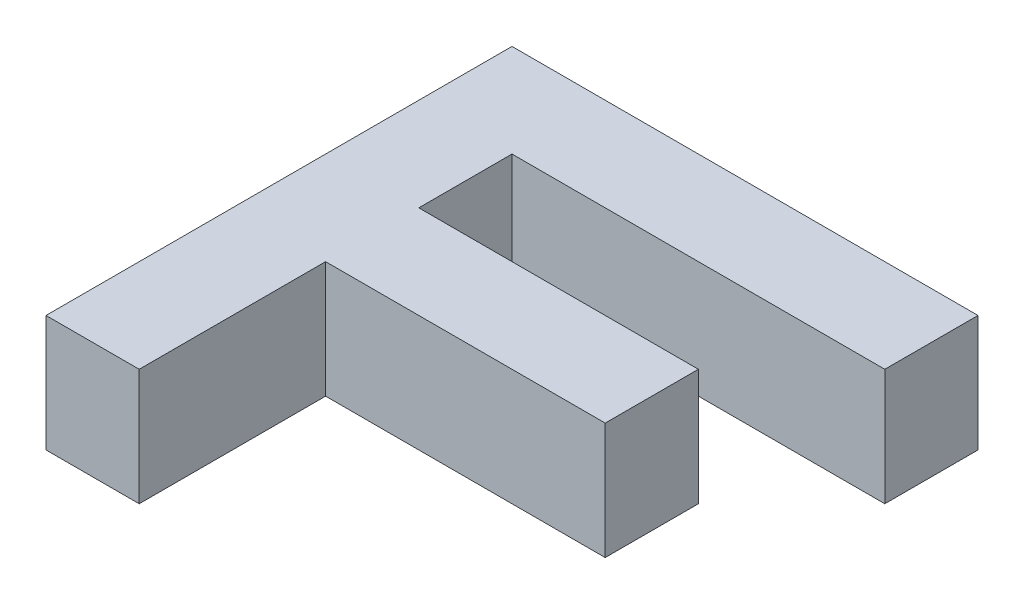
ISO-10303-21;
HEADER;
FILE_DESCRIPTION(('STEP AP214'),'2;1');
FILE_NAME('part.step','',(''),(''),'','','');
FILE_SCHEMA(('AUTOMOTIVE_DESIGN { 1 0 10303 214 1 1 1 1 }'));
ENDSEC;
DATA;
#1=APPLICATION_CONTEXT('core data for automotive mechanical design processes');
#2=APPLICATION_PROTOCOL_DEFINITION('international standard','automotive_design',2000,#1);
#3=PRODUCT_CONTEXT('',#1,'mechanical');
#4=PRODUCT('Part','Part','',(#3));
#5=PRODUCT_RELATED_PRODUCT_CATEGORY('part','',(#4));
#6=PRODUCT_DEFINITION_FORMATION('','',#4);
#7=PRODUCT_DEFINITION_CONTEXT('part definition',#1,'design');
#8=PRODUCT_DEFINITION('design','',#6,#7);
#9=PRODUCT_DEFINITION_SHAPE('','',#8);
#10=(LENGTH_UNIT() NAMED_UNIT(*) SI_UNIT(.MILLI.,.METRE.));
#11=(NAMED_UNIT(*) PLANE_ANGLE_UNIT() SI_UNIT($,.RADIAN.));
#12=(NAMED_UNIT(*) SI_UNIT($,.STERADIAN.) SOLID_ANGLE_UNIT());
#13=UNCERTAINTY_MEASURE_WITH_UNIT(LENGTH_MEASURE(1.E-05),#10,'distance_accuracy_value','');
#14=(GEOMETRIC_REPRESENTATION_CONTEXT(3) GLOBAL_UNCERTAINTY_ASSIGNED_CONTEXT((#13)) GLOBAL_UNIT_ASSIGNED_CONTEXT((#10,
#11,#12)) REPRESENTATION_CONTEXT('',''));
#15=CARTESIAN_POINT('',(0.,0.,0.));
#16=DIRECTION('',(0.,0.,1.));
#17=DIRECTION('',(1.,0.,0.));
#18=AXIS2_PLACEMENT_3D('',#15,#16,#17);
#19=CARTESIAN_POINT('',(258.,10.,0.));
#20=DIRECTION('',(0.,0.,-1.));
#21=DIRECTION('',(-1.,0.,0.));
#22=AXIS2_PLACEMENT_3D('',#19,#20,#21);
#23=PLANE('',#22);
#24=DIRECTION('',(1.,0.,0.));
#25=VECTOR('',#24,1.);
#26=CARTESIAN_POINT('',(258.,0.,0.));
#27=LINE('',#26,#25);
#28=CARTESIAN_POINT('',(250.,0.,0.));
#29=VERTEX_POINT('',#28);
#30=CARTESIAN_POINT('',(258.,0.,0.));
#31=VERTEX_POINT('',#30);
#32=EDGE_CURVE('E141',#29,#31,#27,.T.);
#33=ORIENTED_EDGE('',*,*,#32,.T.);
#34=DIRECTION('',(0.,-1.,0.));
#35=VECTOR('',#34,1.);
#36=CARTESIAN_POINT('',(258.,10.,0.));
#37=LINE('',#36,#35);
#38=CARTESIAN_POINT('',(258.,10.,0.));
#39=VERTEX_POINT('',#38);
#40=EDGE_CURVE('E11',#39,#31,#37,.T.);
#41=ORIENTED_EDGE('',*,*,#40,.F.);
#42=DIRECTION('',(1.,0.,0.));
#43=VECTOR('',#42,1.);
#44=CARTESIAN_POINT('',(258.,10.,0.));
#45=LINE('',#44,#43);
#46=CARTESIAN_POINT('',(250.,10.,0.));
#47=VERTEX_POINT('',#46);
#48=EDGE_CURVE('E159',#47,#39,#45,.T.);
#49=ORIENTED_EDGE('',*,*,#48,.F.);
#50=DIRECTION('',(0.,-1.,0.));
#51=VECTOR('',#50,1.);
#52=CARTESIAN_POINT('',(250.,10.,0.));
#53=LINE('',#52,#51);
#54=EDGE_CURVE('E137',#47,#29,#53,.T.);
#55=ORIENTED_EDGE('',*,*,#54,.T.);
#56=EDGE_LOOP('',(#33,#41,#49,#55));
#57=FACE_BOUND('',#56,.T.);
#58=ADVANCED_FACE('F33',(#57),#23,.F.);
#59=CARTESIAN_POINT('',(258.,10.,-16.));
#60=DIRECTION('',(-1.,0.,0.));
#61=DIRECTION('',(0.,0.,1.));
#62=AXIS2_PLACEMENT_3D('',#59,#60,#61);
#63=PLANE('',#62);
#64=DIRECTION('',(0.,0.,-1.));
#65=VECTOR('',#64,1.);
#66=CARTESIAN_POINT('',(258.,0.,-16.));
#67=LINE('',#66,#65);
#68=CARTESIAN_POINT('',(258.,0.,-16.));
#69=VERTEX_POINT('',#68);
#70=EDGE_CURVE('E144',#31,#69,#67,.T.);
#71=ORIENTED_EDGE('',*,*,#70,.T.);
#72=DIRECTION('',(0.,-1.,0.));
#73=VECTOR('',#72,1.);
#74=CARTESIAN_POINT('',(258.,10.,-16.));
#75=LINE('',#74,#73);
#76=CARTESIAN_POINT('',(258.,10.,-16.));
#77=VERTEX_POINT('',#76);
#78=EDGE_CURVE('E41',#77,#69,#75,.T.);
#79=ORIENTED_EDGE('',*,*,#78,.F.);
#80=DIRECTION('',(0.,0.,-1.));
#81=VECTOR('',#80,1.);
#82=CARTESIAN_POINT('',(258.,10.,-16.));
#83=LINE('',#82,#81);
#84=EDGE_CURVE('E98',#39,#77,#83,.T.);
#85=ORIENTED_EDGE('',*,*,#84,.F.);
#86=ORIENTED_EDGE('',*,*,#40,.T.);
#87=EDGE_LOOP('',(#71,#79,#85,#86));
#88=FACE_BOUND('',#87,.T.);
#89=ADVANCED_FACE('F208',(#88),#63,.F.);
#90=CARTESIAN_POINT('',(282.,10.,-16.));
#91=DIRECTION('',(0.,0.,-1.));
#92=DIRECTION('',(-1.,0.,0.));
#93=AXIS2_PLACEMENT_3D('',#90,#91,#92);
#94=PLANE('',#93);
#95=DIRECTION('',(1.,0.,0.));
#96=VECTOR('',#95,1.);
#97=CARTESIAN_POINT('',(282.,0.,-16.));
#98=LINE('',#97,#96);
#99=CARTESIAN_POINT('',(282.,0.,-16.));
#100=VERTEX_POINT('',#99);
#101=EDGE_CURVE('E146',#69,#100,#98,.T.);
#102=ORIENTED_EDGE('',*,*,#101,.T.);
#103=DIRECTION('',(0.,-1.,0.));
#104=VECTOR('',#103,1.);
#105=CARTESIAN_POINT('',(282.,10.,-16.));
#106=LINE('',#105,#104);
#107=CARTESIAN_POINT('',(282.,10.,-16.));
#108=VERTEX_POINT('',#107);
#109=EDGE_CURVE('E172',#108,#100,#106,.T.);
#110=ORIENTED_EDGE('',*,*,#109,.F.);
#111=DIRECTION('',(1.,0.,0.));
#112=VECTOR('',#111,1.);
#113=CARTESIAN_POINT('',(282.,10.,-16.));
#114=LINE('',#113,#112);
#115=EDGE_CURVE('E180',#77,#108,#114,.T.);
#116=ORIENTED_EDGE('',*,*,#115,.F.);
#117=ORIENTED_EDGE('',*,*,#78,.T.);
#118=EDGE_LOOP('',(#102,#110,#116,#117));
#119=FACE_BOUND('',#118,.T.);
#120=ADVANCED_FACE('F178',(#119),#94,.F.);
#121=CARTESIAN_POINT('',(282.,10.,-24.));
#122=DIRECTION('',(-1.,0.,0.));
#123=DIRECTION('',(0.,0.,1.));
#124=AXIS2_PLACEMENT_3D('',#121,#122,#123);
#125=PLANE('',#124);
#126=DIRECTION('',(0.,0.,-1.));
#127=VECTOR('',#126,1.);
#128=CARTESIAN_POINT('',(282.,0.,-24.));
#129=LINE('',#128,#127);
#130=CARTESIAN_POINT('',(282.,0.,-24.));
#131=VERTEX_POINT('',#130);
#132=EDGE_CURVE('E148',#100,#131,#129,.T.);
#133=ORIENTED_EDGE('',*,*,#132,.T.);
#134=DIRECTION('',(0.,-1.,0.));
#135=VECTOR('',#134,1.);
#136=CARTESIAN_POINT('',(282.,10.,-24.));
#137=LINE('',#136,#135);
#138=CARTESIAN_POINT('',(282.,10.,-24.));
#139=VERTEX_POINT('',#138);
#140=EDGE_CURVE('E169',#139,#131,#137,.T.);
#141=ORIENTED_EDGE('',*,*,#140,.F.);
#142=DIRECTION('',(0.,0.,-1.));
#143=VECTOR('',#142,1.);
#144=CARTESIAN_POINT('',(282.,10.,-24.));
#145=LINE('',#144,#143);
#146=EDGE_CURVE('E198',#108,#139,#145,.T.);
#147=ORIENTED_EDGE('',*,*,#146,.F.);
#148=ORIENTED_EDGE('',*,*,#109,.T.);
#149=EDGE_LOOP('',(#133,#141,#147,#148));
#150=FACE_BOUND('',#149,.T.);
#151=ADVANCED_FACE('F189',(#150),#125,.F.);
#152=CARTESIAN_POINT('',(258.,10.,-24.));
#153=DIRECTION('',(0.,0.,1.));
#154=DIRECTION('',(1.,0.,0.));
#155=AXIS2_PLACEMENT_3D('',#152,#153,#154);
#156=PLANE('',#155);
#157=DIRECTION('',(-1.,0.,0.));
#158=VECTOR('',#157,1.);
#159=CARTESIAN_POINT('',(258.,0.,-24.));
#160=LINE('',#159,#158);
#161=CARTESIAN_POINT('',(258.,0.,-24.));
#162=VERTEX_POINT('',#161);
#163=EDGE_CURVE('E150',#131,#162,#160,.T.);
#164=ORIENTED_EDGE('',*,*,#163,.T.);
#165=DIRECTION('',(0.,-1.,0.));
#166=VECTOR('',#165,1.);
#167=CARTESIAN_POINT('',(258.,10.,-24.));
#168=LINE('',#167,#166);
#169=CARTESIAN_POINT('',(258.,10.,-24.));
#170=VERTEX_POINT('',#169);
#171=EDGE_CURVE('E166',#170,#162,#168,.T.);
#172=ORIENTED_EDGE('',*,*,#171,.F.);
#173=DIRECTION('',(-1.,0.,0.));
#174=VECTOR('',#173,1.);
#175=CARTESIAN_POINT('',(258.,10.,-24.));
#176=LINE('',#175,#174);
#177=EDGE_CURVE('E195',#139,#170,#176,.T.);
#178=ORIENTED_EDGE('',*,*,#177,.F.);
#179=ORIENTED_EDGE('',*,*,#140,.T.);
#180=EDGE_LOOP('',(#164,#172,#178,#179));
#181=FACE_BOUND('',#180,.T.);
#182=ADVANCED_FACE('F193',(#181),#156,.F.);
#183=CARTESIAN_POINT('',(258.,10.,-32.));
#184=DIRECTION('',(-1.,0.,0.));
#185=DIRECTION('',(0.,0.,1.));
#186=AXIS2_PLACEMENT_3D('',#183,#184,#185);
#187=PLANE('',#186);
#188=DIRECTION('',(0.,0.,-1.));
#189=VECTOR('',#188,1.);
#190=CARTESIAN_POINT('',(258.,0.,-32.));
#191=LINE('',#190,#189);
#192=CARTESIAN_POINT('',(258.,0.,-32.));
#193=VERTEX_POINT('',#192);
#194=EDGE_CURVE('E152',#162,#193,#191,.T.);
#195=ORIENTED_EDGE('',*,*,#194,.T.);
#196=DIRECTION('',(0.,-1.,0.));
#197=VECTOR('',#196,1.);
#198=CARTESIAN_POINT('',(258.,10.,-32.));
#199=LINE('',#198,#197);
#200=CARTESIAN_POINT('',(258.,10.,-32.));
#201=VERTEX_POINT('',#200);
#202=EDGE_CURVE('E163',#201,#193,#199,.T.);
#203=ORIENTED_EDGE('',*,*,#202,.F.);
#204=DIRECTION('',(0.,0.,-1.));
#205=VECTOR('',#204,1.);
#206=CARTESIAN_POINT('',(258.,10.,-32.));
#207=LINE('',#206,#205);
#208=EDGE_CURVE('E197',#170,#201,#207,.T.);
#209=ORIENTED_EDGE('',*,*,#208,.F.);
#210=ORIENTED_EDGE('',*,*,#171,.T.);
#211=EDGE_LOOP('',(#195,#203,#209,#210));
#212=FACE_BOUND('',#211,.T.);
#213=ADVANCED_FACE('F220',(#212),#187,.F.);
#214=CARTESIAN_POINT('',(290.,10.,-32.));
#215=DIRECTION('',(0.,0.,-1.));
#216=DIRECTION('',(-1.,0.,0.));
#217=AXIS2_PLACEMENT_3D('',#214,#215,#216);
#218=PLANE('',#217);
#219=DIRECTION('',(1.,0.,0.));
#220=VECTOR('',#219,1.);
#221=CARTESIAN_POINT('',(290.,0.,-32.));
#222=LINE('',#221,#220);
#223=CARTESIAN_POINT('',(290.,0.,-32.));
#224=VERTEX_POINT('',#223);
#225=EDGE_CURVE('E154',#193,#224,#222,.T.);
#226=ORIENTED_EDGE('',*,*,#225,.T.);
#227=DIRECTION('',(0.,-1.,0.));
#228=VECTOR('',#227,1.);
#229=CARTESIAN_POINT('',(290.,10.,-32.));
#230=LINE('',#229,#228);
#231=CARTESIAN_POINT('',(290.,10.,-32.));
#232=VERTEX_POINT('',#231);
#233=EDGE_CURVE('E132',#232,#224,#230,.T.);
#234=ORIENTED_EDGE('',*,*,#233,.F.);
#235=DIRECTION('',(1.,0.,0.));
#236=VECTOR('',#235,1.);
#237=CARTESIAN_POINT('',(290.,10.,-32.));
#238=LINE('',#237,#236);
#239=EDGE_CURVE('E123',#201,#232,#238,.T.);
#240=ORIENTED_EDGE('',*,*,#239,.F.);
#241=ORIENTED_EDGE('',*,*,#202,.T.);
#242=EDGE_LOOP('',(#226,#234,#240,#241));
#243=FACE_BOUND('',#242,.T.);
#244=ADVANCED_FACE('F223',(#243),#218,.F.);
#245=CARTESIAN_POINT('',(290.,10.,-40.));
#246=DIRECTION('',(-1.,0.,0.));
#247=DIRECTION('',(0.,0.,1.));
#248=AXIS2_PLACEMENT_3D('',#245,#246,#247);
#249=PLANE('',#248);
#250=DIRECTION('',(0.,0.,-1.));
#251=VECTOR('',#250,1.);
#252=CARTESIAN_POINT('',(290.,0.,-40.));
#253=LINE('',#252,#251);
#254=CARTESIAN_POINT('',(290.,0.,-40.));
#255=VERTEX_POINT('',#254);
#256=EDGE_CURVE('E131',#224,#255,#253,.T.);
#257=ORIENTED_EDGE('',*,*,#256,.T.);
#258=DIRECTION('',(0.,-1.,0.));
#259=VECTOR('',#258,1.);
#260=CARTESIAN_POINT('',(290.,10.,-40.));
#261=LINE('',#260,#259);
#262=CARTESIAN_POINT('',(290.,10.,-40.));
#263=VERTEX_POINT('',#262);
#264=EDGE_CURVE('E128',#263,#255,#261,.T.);
#265=ORIENTED_EDGE('',*,*,#264,.F.);
#266=DIRECTION('',(0.,0.,-1.));
#267=VECTOR('',#266,1.);
#268=CARTESIAN_POINT('',(290.,10.,-40.));
#269=LINE('',#268,#267);
#270=EDGE_CURVE('E117',#232,#263,#269,.T.);
#271=ORIENTED_EDGE('',*,*,#270,.F.);
#272=ORIENTED_EDGE('',*,*,#233,.T.);
#273=EDGE_LOOP('',(#257,#265,#271,#272));
#274=FACE_BOUND('',#273,.T.);
#275=ADVANCED_FACE('F129',(#274),#249,.F.);
#276=CARTESIAN_POINT('',(250.,10.,-40.));
#277=DIRECTION('',(0.,0.,1.));
#278=DIRECTION('',(1.,0.,0.));
#279=AXIS2_PLACEMENT_3D('',#276,#277,#278);
#280=PLANE('',#279);
#281=DIRECTION('',(-1.,0.,0.));
#282=VECTOR('',#281,1.);
#283=CARTESIAN_POINT('',(250.,0.,-40.));
#284=LINE('',#283,#282);
#285=CARTESIAN_POINT('',(250.,0.,-40.));
#286=VERTEX_POINT('',#285);
#287=EDGE_CURVE('E84',#255,#286,#284,.T.);
#288=ORIENTED_EDGE('',*,*,#287,.T.);
#289=DIRECTION('',(0.,-1.,0.));
#290=VECTOR('',#289,1.);
#291=CARTESIAN_POINT('',(250.,10.,-40.));
#292=LINE('',#291,#290);
#293=CARTESIAN_POINT('',(250.,10.,-40.));
#294=VERTEX_POINT('',#293);
#295=EDGE_CURVE('E133',#294,#286,#292,.T.);
#296=ORIENTED_EDGE('',*,*,#295,.F.);
#297=DIRECTION('',(-1.,0.,0.));
#298=VECTOR('',#297,1.);
#299=CARTESIAN_POINT('',(250.,10.,-40.));
#300=LINE('',#299,#298);
#301=EDGE_CURVE('E121',#263,#294,#300,.T.);
#302=ORIENTED_EDGE('',*,*,#301,.F.);
#303=ORIENTED_EDGE('',*,*,#264,.T.);
#304=EDGE_LOOP('',(#288,#296,#302,#303));
#305=FACE_BOUND('',#304,.T.);
#306=ADVANCED_FACE('F135',(#305),#280,.F.);
#307=CARTESIAN_POINT('',(250.,10.,0.));
#308=DIRECTION('',(1.,0.,0.));
#309=DIRECTION('',(0.,0.,-1.));
#310=AXIS2_PLACEMENT_3D('',#307,#308,#309);
#311=PLANE('',#310);
#312=DIRECTION('',(0.,0.,1.));
#313=VECTOR('',#312,1.);
#314=CARTESIAN_POINT('',(250.,0.,0.));
#315=LINE('',#314,#313);
#316=EDGE_CURVE('E90',#286,#29,#315,.T.);
#317=ORIENTED_EDGE('',*,*,#316,.T.);
#318=ORIENTED_EDGE('',*,*,#54,.F.);
#319=DIRECTION('',(0.,0.,1.));
#320=VECTOR('',#319,1.);
#321=CARTESIAN_POINT('',(250.,10.,0.));
#322=LINE('',#321,#320);
#323=EDGE_CURVE('E49',#294,#47,#322,.T.);
#324=ORIENTED_EDGE('',*,*,#323,.F.);
#325=ORIENTED_EDGE('',*,*,#295,.T.);
#326=EDGE_LOOP('',(#317,#318,#324,#325));
#327=FACE_BOUND('',#326,.T.);
#328=ADVANCED_FACE('F232',(#327),#311,.F.);
#329=CARTESIAN_POINT('',(0.,10.,0.));
#330=DIRECTION('',(0.,-1.,0.));
#331=DIRECTION('',(0.,0.,-1.));
#332=AXIS2_PLACEMENT_3D('',#329,#330,#331);
#333=PLANE('',#332);
#334=ORIENTED_EDGE('',*,*,#48,.T.);
#335=ORIENTED_EDGE('',*,*,#84,.T.);
#336=ORIENTED_EDGE('',*,*,#115,.T.);
#337=ORIENTED_EDGE('',*,*,#146,.T.);
#338=ORIENTED_EDGE('',*,*,#177,.T.);
#339=ORIENTED_EDGE('',*,*,#208,.T.);
#340=ORIENTED_EDGE('',*,*,#239,.T.);
#341=ORIENTED_EDGE('',*,*,#270,.T.);
#342=ORIENTED_EDGE('',*,*,#301,.T.);
#343=ORIENTED_EDGE('',*,*,#323,.T.);
#344=EDGE_LOOP('',(#334,#335,#336,#337,#338,#339,#340,#341,#342,#343));
#345=FACE_BOUND('',#344,.T.);
#346=ADVANCED_FACE('F119',(#345),#333,.F.);
#347=CARTESIAN_POINT('',(0.,0.,0.));
#348=DIRECTION('',(0.,-1.,0.));
#349=DIRECTION('',(0.,0.,-1.));
#350=AXIS2_PLACEMENT_3D('',#347,#348,#349);
#351=PLANE('',#350);
#352=ORIENTED_EDGE('',*,*,#32,.F.);
#353=ORIENTED_EDGE('',*,*,#316,.F.);
#354=ORIENTED_EDGE('',*,*,#287,.F.);
#355=ORIENTED_EDGE('',*,*,#256,.F.);
#356=ORIENTED_EDGE('',*,*,#225,.F.);
#357=ORIENTED_EDGE('',*,*,#194,.F.);
#358=ORIENTED_EDGE('',*,*,#163,.F.);
#359=ORIENTED_EDGE('',*,*,#132,.F.);
#360=ORIENTED_EDGE('',*,*,#101,.F.);
#361=ORIENTED_EDGE('',*,*,#70,.F.);
#362=EDGE_LOOP('',(#352,#353,#354,#355,#356,#357,#358,#359,#360,#361));
#363=FACE_BOUND('',#362,.T.);
#364=ADVANCED_FACE('F184',(#363),#351,.T.);
#365=CLOSED_SHELL('',(#58,#89,#120,#151,#182,#213,#244,#275,#306,#328,#346,#364));
#366=MANIFOLD_SOLID_BREP('B2',#365);
#367=ADVANCED_BREP_SHAPE_REPRESENTATION('',(#18,#366),#14);
#368=SHAPE_DEFINITION_REPRESENTATION(#9,#367);
ENDSEC;
END-ISO-10303-21;
